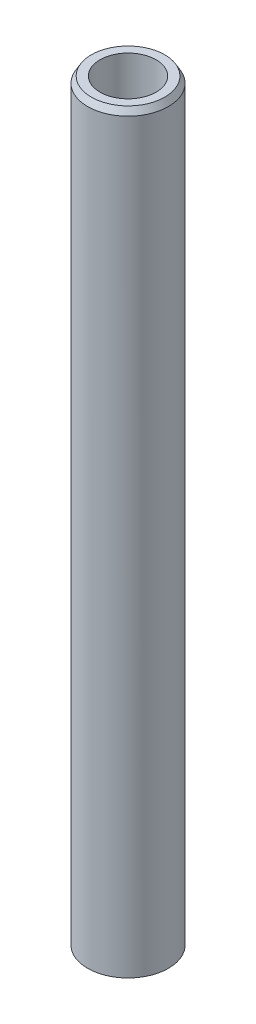
ISO-10303-21;
HEADER;
FILE_DESCRIPTION(('STEP AP214'),'2;1');
FILE_NAME('part.step','',(''),(''),'','','');
FILE_SCHEMA(('AUTOMOTIVE_DESIGN { 1 0 10303 214 1 1 1 1 }'));
ENDSEC;
DATA;
#1=APPLICATION_CONTEXT('core data for automotive mechanical design processes');
#2=APPLICATION_PROTOCOL_DEFINITION('international standard','automotive_design',2000,#1);
#3=PRODUCT_CONTEXT('',#1,'mechanical');
#4=PRODUCT('Part','Part','',(#3));
#5=PRODUCT_RELATED_PRODUCT_CATEGORY('part','',(#4));
#6=PRODUCT_DEFINITION_FORMATION('','',#4);
#7=PRODUCT_DEFINITION_CONTEXT('part definition',#1,'design');
#8=PRODUCT_DEFINITION('design','',#6,#7);
#9=PRODUCT_DEFINITION_SHAPE('','',#8);
#10=(LENGTH_UNIT() NAMED_UNIT(*) SI_UNIT(.MILLI.,.METRE.));
#11=(NAMED_UNIT(*) PLANE_ANGLE_UNIT() SI_UNIT($,.RADIAN.));
#12=(NAMED_UNIT(*) SI_UNIT($,.STERADIAN.) SOLID_ANGLE_UNIT());
#13=UNCERTAINTY_MEASURE_WITH_UNIT(LENGTH_MEASURE(1.E-05),#10,'distance_accuracy_value','');
#14=(GEOMETRIC_REPRESENTATION_CONTEXT(3) GLOBAL_UNCERTAINTY_ASSIGNED_CONTEXT((#13)) GLOBAL_UNIT_ASSIGNED_CONTEXT((#10,
#11,#12)) REPRESENTATION_CONTEXT('',''));
#15=CARTESIAN_POINT('',(0.,0.,0.));
#16=DIRECTION('',(0.,0.,1.));
#17=DIRECTION('',(1.,0.,0.));
#18=AXIS2_PLACEMENT_3D('',#15,#16,#17);
#19=CARTESIAN_POINT('',(0.,187.323336994886,0.));
#20=DIRECTION('',(0.,-1.,0.));
#21=DIRECTION('',(0.,0.,-1.));
#22=AXIS2_PLACEMENT_3D('',#19,#20,#21);
#23=CYLINDRICAL_SURFACE('',#22,10.);
#24=CARTESIAN_POINT('',(0.,185.752395093004,0.));
#25=DIRECTION('',(0.,1.,0.));
#26=DIRECTION('',(0.,0.,1.));
#27=AXIS2_PLACEMENT_3D('',#24,#25,#26);
#28=CIRCLE('',#27,10.);
#29=CARTESIAN_POINT('',(0.,185.752395093004,-10.));
#30=VERTEX_POINT('',#29);
#31=EDGE_CURVE('E50',#30,#30,#28,.F.);
#32=ORIENTED_EDGE('',*,*,#31,.T.);
#33=EDGE_LOOP('',(#32));
#34=FACE_BOUND('',#33,.T.);
#35=CARTESIAN_POINT('',(0.,0.906983729932864,0.));
#36=DIRECTION('',(0.,1.,0.));
#37=DIRECTION('',(0.,0.,1.));
#38=AXIS2_PLACEMENT_3D('',#35,#36,#37);
#39=CIRCLE('',#38,10.);
#40=CARTESIAN_POINT('',(0.,0.906983729932864,10.));
#41=VERTEX_POINT('',#40);
#42=EDGE_CURVE('E51',#41,#41,#39,.T.);
#43=ORIENTED_EDGE('',*,*,#42,.T.);
#44=EDGE_LOOP('',(#43));
#45=FACE_BOUND('',#44,.T.);
#46=ADVANCED_FACE('F39',(#34,#45),#23,.T.);
#47=CARTESIAN_POINT('',(0.,187.323336994886,0.));
#48=DIRECTION('',(0.,1.,0.));
#49=DIRECTION('',(0.,0.,1.));
#50=AXIS2_PLACEMENT_3D('',#47,#48,#49);
#51=PLANE('',#50);
#52=CARTESIAN_POINT('',(0.,187.323336994886,0.));
#53=DIRECTION('',(0.,1.,0.));
#54=DIRECTION('',(0.,0.,1.));
#55=AXIS2_PLACEMENT_3D('',#52,#53,#54);
#56=CIRCLE('',#55,9.0930162700671);
#57=CARTESIAN_POINT('',(0.,187.323336994886,-9.09301627006711));
#58=VERTEX_POINT('',#57);
#59=EDGE_CURVE('E54',#58,#58,#56,.T.);
#60=ORIENTED_EDGE('',*,*,#59,.T.);
#61=EDGE_LOOP('',(#60));
#62=FACE_BOUND('',#61,.T.);
#63=CARTESIAN_POINT('',(0.,187.323336994886,0.));
#64=DIRECTION('',(0.,1.,0.));
#65=DIRECTION('',(0.,0.,1.));
#66=AXIS2_PLACEMENT_3D('',#63,#64,#65);
#67=CIRCLE('',#66,6.95459753266231);
#68=CARTESIAN_POINT('',(0.,187.323336994886,6.95459753266231));
#69=VERTEX_POINT('',#68);
#70=EDGE_CURVE('E58',#69,#69,#67,.T.);
#71=ORIENTED_EDGE('',*,*,#70,.F.);
#72=EDGE_LOOP('',(#71));
#73=FACE_BOUND('',#72,.T.);
#74=ADVANCED_FACE('F69',(#62,#73),#51,.T.);
#75=CARTESIAN_POINT('',(0.,0.,0.));
#76=DIRECTION('',(0.,1.,0.));
#77=DIRECTION('',(0.,0.,1.));
#78=AXIS2_PLACEMENT_3D('',#75,#76,#77);
#79=PLANE('',#78);
#80=CARTESIAN_POINT('',(0.,0.,0.));
#81=DIRECTION('',(0.,1.,0.));
#82=DIRECTION('',(0.,0.,1.));
#83=AXIS2_PLACEMENT_3D('',#80,#81,#82);
#84=CIRCLE('',#83,8.42905809811792);
#85=CARTESIAN_POINT('',(0.,0.,8.42905809811792));
#86=VERTEX_POINT('',#85);
#87=EDGE_CURVE('E10',#86,#86,#84,.F.);
#88=ORIENTED_EDGE('',*,*,#87,.T.);
#89=EDGE_LOOP('',(#88));
#90=FACE_BOUND('',#89,.T.);
#91=CARTESIAN_POINT('',(0.,0.,0.));
#92=DIRECTION('',(0.,1.,0.));
#93=DIRECTION('',(0.,0.,1.));
#94=AXIS2_PLACEMENT_3D('',#91,#92,#93);
#95=CIRCLE('',#94,6.95459753266231);
#96=CARTESIAN_POINT('',(0.,0.,6.95459753266231));
#97=VERTEX_POINT('',#96);
#98=EDGE_CURVE('E63',#97,#97,#95,.T.);
#99=ORIENTED_EDGE('',*,*,#98,.T.);
#100=EDGE_LOOP('',(#99));
#101=FACE_BOUND('',#100,.T.);
#102=ADVANCED_FACE('F75',(#90,#101),#79,.F.);
#103=CARTESIAN_POINT('',(0.,187.323336994886,0.));
#104=DIRECTION('',(0.,-1.,0.));
#105=DIRECTION('',(0.,0.,-1.));
#106=AXIS2_PLACEMENT_3D('',#103,#104,#105);
#107=CYLINDRICAL_SURFACE('',#106,6.95459753266231);
#108=ORIENTED_EDGE('',*,*,#70,.T.);
#109=EDGE_LOOP('',(#108));
#110=FACE_BOUND('',#109,.T.);
#111=ORIENTED_EDGE('',*,*,#98,.F.);
#112=EDGE_LOOP('',(#111));
#113=FACE_BOUND('',#112,.T.);
#114=ADVANCED_FACE('F70',(#110,#113),#107,.F.);
#115=CARTESIAN_POINT('',(0.,187.323336994886,0.));
#116=DIRECTION('',(0.,-1.,0.));
#117=DIRECTION('',(0.,0.,-1.));
#118=AXIS2_PLACEMENT_3D('',#115,#116,#117);
#119=CONICAL_SURFACE('',#118,9.0930162700671,0.523598775598288);
#120=CARTESIAN_POINT('',(0.,185.752395093004,-10.));
#121=CARTESIAN_POINT('',(0.,185.768759071149,-9.99055225281321));
#122=CARTESIAN_POINT('',(0.,185.785123049293,-9.98110450562641));
#123=CARTESIAN_POINT('',(0.,185.817851005583,-9.96220901125281));
#124=CARTESIAN_POINT('',(0.,185.834214983727,-9.95276126406601));
#125=CARTESIAN_POINT('',(0.,185.866942940017,-9.9338657696924));
#126=CARTESIAN_POINT('',(0.,185.883306918161,-9.9244180225056));
#127=CARTESIAN_POINT('',(0.,185.91603487445,-9.905522528132));
#128=CARTESIAN_POINT('',(0.,185.932398852595,-9.8960747809452));
#129=CARTESIAN_POINT('',(0.,185.965126808884,-9.8771792865716));
#130=CARTESIAN_POINT('',(0.,185.981490787029,-9.8677315393848));
#131=CARTESIAN_POINT('',(0.,186.014218743318,-9.84883604501119));
#132=CARTESIAN_POINT('',(0.,186.030582721463,-9.83938829782439));
#133=CARTESIAN_POINT('',(0.,186.063310677752,-9.82049280345079));
#134=CARTESIAN_POINT('',(0.,186.079674655896,-9.81104505626399));
#135=CARTESIAN_POINT('',(0.,186.112402612186,-9.79214956189039));
#136=CARTESIAN_POINT('',(0.,186.12876659033,-9.78270181470359));
#137=CARTESIAN_POINT('',(0.,186.161494546619,-9.76380632032999));
#138=CARTESIAN_POINT('',(0.,186.177858524764,-9.75435857314318));
#139=CARTESIAN_POINT('',(0.,186.210586481053,-9.73546307876958));
#140=CARTESIAN_POINT('',(0.,186.226950459198,-9.72601533158278));
#141=CARTESIAN_POINT('',(0.,186.259678415487,-9.70711983720918));
#142=CARTESIAN_POINT('',(0.,186.276042393632,-9.69767209002238));
#143=CARTESIAN_POINT('',(0.,186.308770349921,-9.67877659564878));
#144=CARTESIAN_POINT('',(0.,186.325134328065,-9.66932884846197));
#145=CARTESIAN_POINT('',(0.,186.357862284355,-9.65043335408837));
#146=CARTESIAN_POINT('',(0.,186.374226262499,-9.64098560690157));
#147=CARTESIAN_POINT('',(0.,186.406954218789,-9.62209011252797));
#148=CARTESIAN_POINT('',(0.,186.423318196933,-9.61264236534116));
#149=CARTESIAN_POINT('',(0.,186.456046153222,-9.59374687096756));
#150=CARTESIAN_POINT('',(0.,186.472410131367,-9.58429912378077));
#151=CARTESIAN_POINT('',(0.,186.505138087656,-9.56540362940716));
#152=CARTESIAN_POINT('',(0.,186.521502065801,-9.55595588222036));
#153=CARTESIAN_POINT('',(0.,186.55423002209,-9.53706038784676));
#154=CARTESIAN_POINT('',(0.,186.570594000235,-9.52761264065995));
#155=CARTESIAN_POINT('',(0.,186.603321956524,-9.50871714628635));
#156=CARTESIAN_POINT('',(0.,186.619685934668,-9.49926939909956));
#157=CARTESIAN_POINT('',(0.,186.652413890958,-9.48037390472595));
#158=CARTESIAN_POINT('',(0.,186.668777869102,-9.47092615753915));
#159=CARTESIAN_POINT('',(0.,186.701505825391,-9.45203066316555));
#160=CARTESIAN_POINT('',(0.,186.717869803536,-9.44258291597875));
#161=CARTESIAN_POINT('',(0.,186.750597759825,-9.42368742160515));
#162=CARTESIAN_POINT('',(0.,186.76696173797,-9.41423967441834));
#163=CARTESIAN_POINT('',(0.,186.799689694259,-9.39534418004474));
#164=CARTESIAN_POINT('',(0.,186.816053672404,-9.38589643285794));
#165=CARTESIAN_POINT('',(0.,186.848781628693,-9.36700093848434));
#166=CARTESIAN_POINT('',(0.,186.865145606837,-9.35755319129754));
#167=CARTESIAN_POINT('',(0.,186.897873563127,-9.33865769692393));
#168=CARTESIAN_POINT('',(0.,186.914237541271,-9.32920994973713));
#169=CARTESIAN_POINT('',(0.,186.94696549756,-9.31031445536353));
#170=CARTESIAN_POINT('',(0.,186.963329475705,-9.30086670817674));
#171=CARTESIAN_POINT('',(0.,186.996057431994,-9.28197121380314));
#172=CARTESIAN_POINT('',(0.,187.012421410139,-9.27252346661633));
#173=CARTESIAN_POINT('',(0.,187.045149366428,-9.25362797224273));
#174=CARTESIAN_POINT('',(0.,187.061513344573,-9.24418022505593));
#175=CARTESIAN_POINT('',(0.,187.094241300862,-9.22528473068233));
#176=CARTESIAN_POINT('',(0.,187.110605279007,-9.21583698349552));
#177=CARTESIAN_POINT('',(0.,187.143333235296,-9.19694148912192));
#178=CARTESIAN_POINT('',(0.,187.15969721344,-9.18749374193512));
#179=CARTESIAN_POINT('',(0.,187.19242516973,-9.16859824756152));
#180=CARTESIAN_POINT('',(0.,187.208789147874,-9.15915050037472));
#181=CARTESIAN_POINT('',(0.,187.241517104163,-9.14025500600112));
#182=CARTESIAN_POINT('',(0.,187.257881082308,-9.13080725881431));
#183=CARTESIAN_POINT('',(0.,187.290609038597,-9.11191176444071));
#184=CARTESIAN_POINT('',(0.,187.306973016742,-9.10246401725391));
#185=CARTESIAN_POINT('',(0.,187.323336994886,-9.09301627006711));
#186=B_SPLINE_CURVE_WITH_KNOTS('',3,(#120,#121,#122,#123,#124,#125,#126,#127,#128,#129,#130,
#131,#132,#133,#134,#135,#136,#137,#138,#139,#140,#141,#142,#143,#144,#145,#146,#147,#148,#149,
#150,#151,#152,#153,#154,#155,#156,#157,#158,#159,#160,#161,#162,#163,#164,#165,#166,#167,#168,
#169,#170,#171,#172,#173,#174,#175,#176,#177,#178,#179,#180,#181,#182,#183,#184,#185),
.UNSPECIFIED.,.F.,.F.,(4,2,2,2,2,2,2,2,2,2,2,2,2,2,2,2,2,2,2,2,2,2,2,2,2,2,2,2,2,2,2,2,4),(0.,
0.0566864831208247,0.113372966241625,0.170059449362425,0.22674593248325,0.28343241560405,
0.34011889872485,0.39680538184565,0.453491864966475,0.510178348087276,0.566864831208076,
0.6235513143289,0.6802377974497,0.736924280570501,0.793610763691301,0.850297246812125,
0.906983729932926,0.963670213053726,1.02035669617455,1.07704317929535,1.13372966241615,
1.19041614553695,1.24710262865778,1.30378911177858,1.36047559489938,1.4171620780202,
1.473848561141,1.5305350442618,1.5872215273826,1.64390801050343,1.70059449362423,
1.75728097674503,1.81396745986585),.UNSPECIFIED.);
#187=EDGE_CURVE('BSEAM81',#30,#58,#186,.T.);
#188=ORIENTED_EDGE('',*,*,#31,.F.);
#189=ORIENTED_EDGE('',*,*,#59,.F.);
#190=ORIENTED_EDGE('',*,*,#187,.T.);
#191=ORIENTED_EDGE('',*,*,#187,.F.);
#192=EDGE_LOOP('',(#188,#190,#189,#191));
#193=FACE_BOUND('',#192,.T.);
#194=ADVANCED_FACE('F81',(#193),#119,.T.);
#195=CARTESIAN_POINT('',(0.,0.906983729932864,0.));
#196=DIRECTION('',(0.,1.,0.));
#197=DIRECTION('',(0.,0.,1.));
#198=AXIS2_PLACEMENT_3D('',#195,#196,#197);
#199=CONICAL_SURFACE('',#198,10.,1.04719755119661);
#200=ORIENTED_EDGE('',*,*,#87,.F.);
#201=EDGE_LOOP('',(#200));
#202=FACE_BOUND('',#201,.T.);
#203=ORIENTED_EDGE('',*,*,#42,.F.);
#204=EDGE_LOOP('',(#203));
#205=FACE_BOUND('',#204,.T.);
#206=ADVANCED_FACE('F45',(#202,#205),#199,.T.);
#207=CLOSED_SHELL('',(#46,#74,#102,#114,#194,#206));
#208=MANIFOLD_SOLID_BREP('B2',#207);
#209=ADVANCED_BREP_SHAPE_REPRESENTATION('',(#18,#208),#14);
#210=SHAPE_DEFINITION_REPRESENTATION(#9,#209);
ENDSEC;
END-ISO-10303-21;
